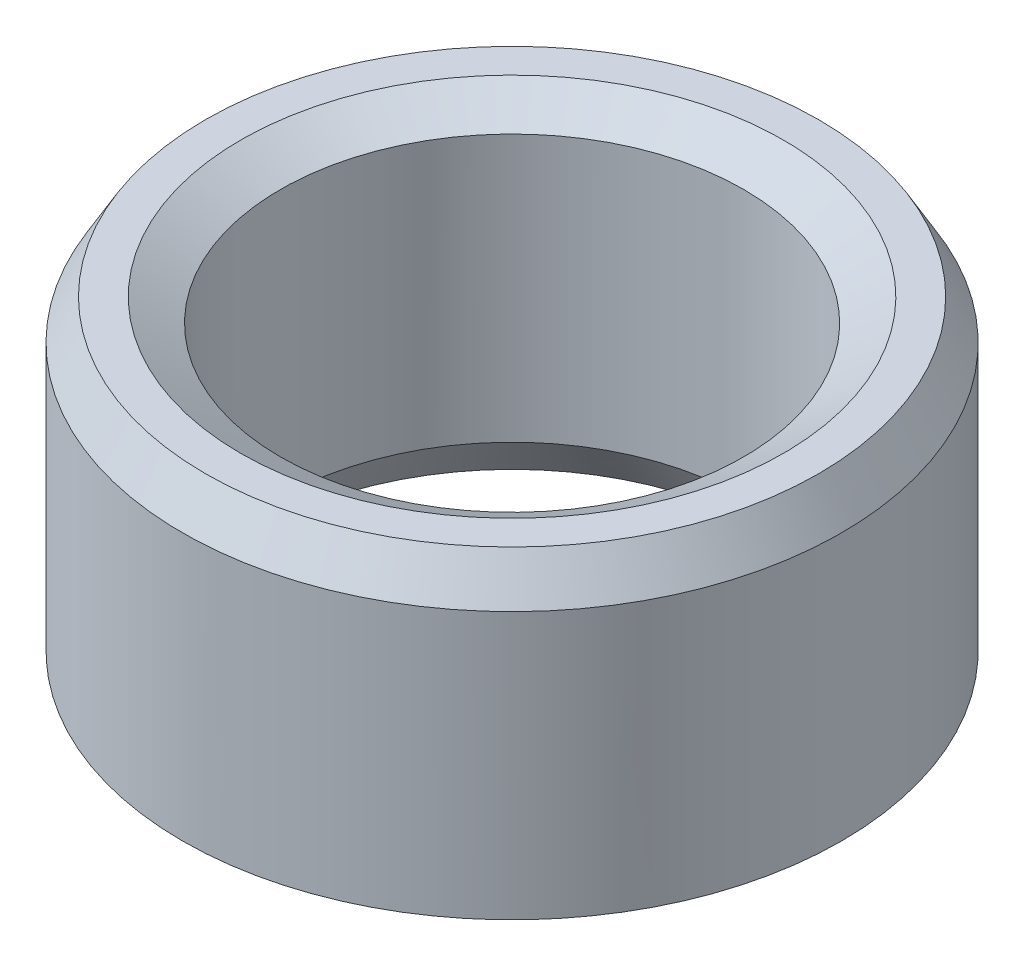
ISO-10303-21;
HEADER;
FILE_DESCRIPTION(('STEP AP214'),'2;1');
FILE_NAME('part.step','',(''),(''),'','','');
FILE_SCHEMA(('AUTOMOTIVE_DESIGN { 1 0 10303 214 1 1 1 1 }'));
ENDSEC;
DATA;
#1=APPLICATION_CONTEXT('core data for automotive mechanical design processes');
#2=APPLICATION_PROTOCOL_DEFINITION('international standard','automotive_design',2000,#1);
#3=PRODUCT_CONTEXT('',#1,'mechanical');
#4=PRODUCT('Part','Part','',(#3));
#5=PRODUCT_RELATED_PRODUCT_CATEGORY('part','',(#4));
#6=PRODUCT_DEFINITION_FORMATION('','',#4);
#7=PRODUCT_DEFINITION_CONTEXT('part definition',#1,'design');
#8=PRODUCT_DEFINITION('design','',#6,#7);
#9=PRODUCT_DEFINITION_SHAPE('','',#8);
#10=(LENGTH_UNIT() NAMED_UNIT(*) SI_UNIT(.MILLI.,.METRE.));
#11=(NAMED_UNIT(*) PLANE_ANGLE_UNIT() SI_UNIT($,.RADIAN.));
#12=(NAMED_UNIT(*) SI_UNIT($,.STERADIAN.) SOLID_ANGLE_UNIT());
#13=UNCERTAINTY_MEASURE_WITH_UNIT(LENGTH_MEASURE(1.E-05),#10,'distance_accuracy_value','');
#14=(GEOMETRIC_REPRESENTATION_CONTEXT(3) GLOBAL_UNCERTAINTY_ASSIGNED_CONTEXT((#13)) GLOBAL_UNIT_ASSIGNED_CONTEXT((#10,
#11,#12)) REPRESENTATION_CONTEXT('',''));
#15=CARTESIAN_POINT('',(0.,0.,0.));
#16=DIRECTION('',(0.,0.,1.));
#17=DIRECTION('',(1.,0.,0.));
#18=AXIS2_PLACEMENT_3D('',#15,#16,#17);
#19=CARTESIAN_POINT('',(0.,29.9992679971099,0.));
#20=DIRECTION('',(0.,-1.,0.));
#21=DIRECTION('',(0.,0.,-1.));
#22=AXIS2_PLACEMENT_3D('',#19,#20,#21);
#23=CYLINDRICAL_SURFACE('',#22,30.);
#24=CARTESIAN_POINT('',(0.,2.0882425429334,0.));
#25=DIRECTION('',(0.,1.,0.));
#26=DIRECTION('',(0.,0.,1.));
#27=AXIS2_PLACEMENT_3D('',#24,#25,#26);
#28=CIRCLE('',#27,30.);
#29=CARTESIAN_POINT('',(0.,2.0882425429334,-30.));
#30=VERTEX_POINT('',#29);
#31=EDGE_CURVE('E10',#30,#30,#28,.T.);
#32=CARTESIAN_POINT('',(0.,26.3823258142225,0.));
#33=DIRECTION('',(0.,1.,0.));
#34=DIRECTION('',(0.,0.,1.));
#35=AXIS2_PLACEMENT_3D('',#32,#33,#34);
#36=CIRCLE('',#35,30.);
#37=CARTESIAN_POINT('',(0.,26.3823258142225,-30.));
#38=VERTEX_POINT('',#37);
#39=EDGE_CURVE('E50',#38,#38,#36,.F.);
#40=CARTESIAN_POINT('',(0.,2.0882425429334,-30.));
#41=CARTESIAN_POINT('',(0.,2.34130591034266,-30.));
#42=CARTESIAN_POINT('',(0.,2.59436927775192,-30.));
#43=CARTESIAN_POINT('',(0.,3.10049601257045,-30.));
#44=CARTESIAN_POINT('',(0.,3.35355937997971,-30.));
#45=CARTESIAN_POINT('',(0.,3.85968611479823,-30.));
#46=CARTESIAN_POINT('',(0.,4.11274948220749,-30.));
#47=CARTESIAN_POINT('',(0.,4.61887621702602,-30.));
#48=CARTESIAN_POINT('',(0.,4.87193958443528,-30.));
#49=CARTESIAN_POINT('',(0.,5.3780663192538,-30.));
#50=CARTESIAN_POINT('',(0.,5.63112968666306,-30.));
#51=CARTESIAN_POINT('',(0.,6.13725642148159,-30.));
#52=CARTESIAN_POINT('',(0.,6.39031978889085,-30.));
#53=CARTESIAN_POINT('',(0.,6.89644652370937,-30.));
#54=CARTESIAN_POINT('',(0.,7.14950989111863,-30.));
#55=CARTESIAN_POINT('',(0.,7.65563662593716,-30.));
#56=CARTESIAN_POINT('',(0.,7.90869999334642,-30.));
#57=CARTESIAN_POINT('',(0.,8.41482672816494,-30.));
#58=CARTESIAN_POINT('',(0.,8.6678900955742,-30.));
#59=CARTESIAN_POINT('',(0.,9.17401683039273,-30.));
#60=CARTESIAN_POINT('',(0.,9.42708019780199,-30.));
#61=CARTESIAN_POINT('',(0.,9.93320693262051,-30.));
#62=CARTESIAN_POINT('',(0.,10.1862703000298,-30.));
#63=CARTESIAN_POINT('',(0.,10.6923970348483,-30.));
#64=CARTESIAN_POINT('',(0.,10.9454604022576,-30.));
#65=CARTESIAN_POINT('',(0.,11.4515871370761,-30.));
#66=CARTESIAN_POINT('',(0.,11.7046505044853,-30.));
#67=CARTESIAN_POINT('',(0.,12.2107772393039,-30.));
#68=CARTESIAN_POINT('',(0.,12.4638406067131,-30.));
#69=CARTESIAN_POINT('',(0.,12.9699673415317,-30.));
#70=CARTESIAN_POINT('',(0.,13.2230307089409,-30.));
#71=CARTESIAN_POINT('',(0.,13.7291574437594,-30.));
#72=CARTESIAN_POINT('',(0.,13.9822208111687,-30.));
#73=CARTESIAN_POINT('',(0.,14.4883475459872,-30.));
#74=CARTESIAN_POINT('',(0.,14.7414109133965,-30.));
#75=CARTESIAN_POINT('',(0.,15.247537648215,-30.));
#76=CARTESIAN_POINT('',(0.,15.5006010156243,-30.));
#77=CARTESIAN_POINT('',(0.,16.0067277504428,-30.));
#78=CARTESIAN_POINT('',(0.,16.2597911178521,-30.));
#79=CARTESIAN_POINT('',(0.,16.7659178526706,-30.));
#80=CARTESIAN_POINT('',(0.,17.0189812200798,-30.));
#81=CARTESIAN_POINT('',(0.,17.5251079548984,-30.));
#82=CARTESIAN_POINT('',(0.,17.7781713223076,-30.));
#83=CARTESIAN_POINT('',(0.,18.2842980571262,-30.));
#84=CARTESIAN_POINT('',(0.,18.5373614245354,-30.));
#85=CARTESIAN_POINT('',(0.,19.0434881593539,-30.));
#86=CARTESIAN_POINT('',(0.,19.2965515267632,-30.));
#87=CARTESIAN_POINT('',(0.,19.8026782615817,-30.));
#88=CARTESIAN_POINT('',(0.,20.055741628991,-30.));
#89=CARTESIAN_POINT('',(0.,20.5618683638095,-30.));
#90=CARTESIAN_POINT('',(0.,20.8149317312188,-30.));
#91=CARTESIAN_POINT('',(0.,21.3210584660373,-30.));
#92=CARTESIAN_POINT('',(0.,21.5741218334466,-30.));
#93=CARTESIAN_POINT('',(0.,22.0802485682651,-30.));
#94=CARTESIAN_POINT('',(0.,22.3333119356743,-30.));
#95=CARTESIAN_POINT('',(0.,22.8394386704929,-30.));
#96=CARTESIAN_POINT('',(0.,23.0925020379021,-30.));
#97=CARTESIAN_POINT('',(0.,23.5986287727206,-30.));
#98=CARTESIAN_POINT('',(0.,23.8516921401299,-30.));
#99=CARTESIAN_POINT('',(0.,24.3578188749484,-30.));
#100=CARTESIAN_POINT('',(0.,24.6108822423577,-30.));
#101=CARTESIAN_POINT('',(0.,25.1170089771762,-30.));
#102=CARTESIAN_POINT('',(0.,25.3700723445855,-30.));
#103=CARTESIAN_POINT('',(0.,25.876199079404,-30.));
#104=CARTESIAN_POINT('',(0.,26.1292624468133,-30.));
#105=CARTESIAN_POINT('',(0.,26.3823258142225,-30.));
#106=B_SPLINE_CURVE_WITH_KNOTS('',3,(#40,#41,#42,#43,#44,#45,#46,#47,#48,#49,#50,#51,#52,#53,
#54,#55,#56,#57,#58,#59,#60,#61,#62,#63,#64,#65,#66,#67,#68,#69,#70,#71,#72,#73,#74,#75,#76,#77,
#78,#79,#80,#81,#82,#83,#84,#85,#86,#87,#88,#89,#90,#91,#92,#93,#94,#95,#96,#97,#98,#99,#100,
#101,#102,#103,#104,#105),.UNSPECIFIED.,.F.,.F.,(4,2,2,2,2,2,2,2,2,2,2,2,2,2,2,2,2,2,2,2,2,2,2,
2,2,2,2,2,2,2,2,2,4),(0.,0.759190102227785,1.51838020445557,2.27757030668336,3.03676040891114,
3.79595051113893,4.55514061336671,5.3143307155945,6.07352081782228,6.83271092005007,
7.59190102227785,8.35109112450564,9.11028122673342,9.86947132896121,10.628661431189,
11.3878515334168,12.1470416356446,12.9062317378723,13.6654218401001,14.4246119423279,
15.1838020445557,15.9429921467835,16.7021822490113,17.4613723512391,18.2205624534668,
18.9797525556946,19.7389426579224,20.4981327601502,21.257322862378,22.0165129646058,
22.7757030668336,23.5348931690613,24.2940832712891),.UNSPECIFIED.);
#107=EDGE_CURVE('BSEAM39',#30,#38,#106,.T.);
#108=ORIENTED_EDGE('',*,*,#31,.T.);
#109=ORIENTED_EDGE('',*,*,#39,.T.);
#110=ORIENTED_EDGE('',*,*,#107,.T.);
#111=ORIENTED_EDGE('',*,*,#107,.F.);
#112=EDGE_LOOP('',(#108,#110,#109,#111));
#113=FACE_BOUND('',#112,.T.);
#114=ADVANCED_FACE('F39',(#113),#23,.T.);
#115=CARTESIAN_POINT('',(0.,29.9992679971099,0.));
#116=DIRECTION('',(0.,1.,0.));
#117=DIRECTION('',(0.,0.,1.));
#118=AXIS2_PLACEMENT_3D('',#115,#116,#117);
#119=PLANE('',#118);
#120=CARTESIAN_POINT('',(0.,29.9992679971099,0.));
#121=DIRECTION('',(0.,1.,0.));
#122=DIRECTION('',(0.,0.,1.));
#123=AXIS2_PLACEMENT_3D('',#120,#121,#122);
#124=CIRCLE('',#123,24.7042899830472);
#125=CARTESIAN_POINT('',(0.,29.9992679971099,24.7042899830472));
#126=VERTEX_POINT('',#125);
#127=EDGE_CURVE('E58',#126,#126,#124,.F.);
#128=ORIENTED_EDGE('',*,*,#127,.T.);
#129=EDGE_LOOP('',(#128));
#130=FACE_BOUND('',#129,.T.);
#131=CARTESIAN_POINT('',(0.,29.9992679971099,0.));
#132=DIRECTION('',(0.,1.,0.));
#133=DIRECTION('',(0.,0.,1.));
#134=AXIS2_PLACEMENT_3D('',#131,#132,#133);
#135=CIRCLE('',#134,27.9117574570667);
#136=CARTESIAN_POINT('',(0.,29.9992679971099,27.9117574570667));
#137=VERTEX_POINT('',#136);
#138=EDGE_CURVE('E61',#137,#137,#135,.T.);
#139=ORIENTED_EDGE('',*,*,#138,.T.);
#140=EDGE_LOOP('',(#139));
#141=FACE_BOUND('',#140,.T.);
#142=ADVANCED_FACE('F88',(#130,#141),#119,.T.);
#143=CARTESIAN_POINT('',(0.,0.,0.));
#144=DIRECTION('',(0.,1.,0.));
#145=DIRECTION('',(0.,0.,1.));
#146=AXIS2_PLACEMENT_3D('',#143,#144,#145);
#147=PLANE('',#146);
#148=CARTESIAN_POINT('',(0.,0.,0.));
#149=DIRECTION('',(0.,1.,0.));
#150=DIRECTION('',(0.,0.,1.));
#151=AXIS2_PLACEMENT_3D('',#148,#149,#150);
#152=CIRCLE('',#151,23.175590343093);
#153=CARTESIAN_POINT('',(0.,0.,23.175590343093));
#154=VERTEX_POINT('',#153);
#155=EDGE_CURVE('E51',#154,#154,#152,.T.);
#156=ORIENTED_EDGE('',*,*,#155,.T.);
#157=EDGE_LOOP('',(#156));
#158=FACE_BOUND('',#157,.T.);
#159=CARTESIAN_POINT('',(0.,0.,0.));
#160=DIRECTION('',(0.,1.,0.));
#161=DIRECTION('',(0.,0.,1.));
#162=AXIS2_PLACEMENT_3D('',#159,#160,#161);
#163=CIRCLE('',#162,26.3830578171125);
#164=CARTESIAN_POINT('',(0.,0.,26.3830578171125));
#165=VERTEX_POINT('',#164);
#166=EDGE_CURVE('E54',#165,#165,#163,.F.);
#167=ORIENTED_EDGE('',*,*,#166,.T.);
#168=EDGE_LOOP('',(#167));
#169=FACE_BOUND('',#168,.T.);
#170=ADVANCED_FACE('F83',(#158,#169),#147,.F.);
#171=CARTESIAN_POINT('',(0.,29.9992679971099,0.));
#172=DIRECTION('',(0.,-1.,0.));
#173=DIRECTION('',(0.,0.,-1.));
#174=AXIS2_PLACEMENT_3D('',#171,#172,#173);
#175=CYLINDRICAL_SURFACE('',#174,21.0873478001597);
#176=CARTESIAN_POINT('',(0.,27.9110254541765,0.));
#177=DIRECTION('',(0.,1.,0.));
#178=DIRECTION('',(0.,0.,1.));
#179=AXIS2_PLACEMENT_3D('',#176,#177,#178);
#180=CIRCLE('',#179,21.0873478001597);
#181=CARTESIAN_POINT('',(0.,27.9110254541765,-21.0873478001597));
#182=VERTEX_POINT('',#181);
#183=EDGE_CURVE('E67',#182,#182,#180,.T.);
#184=CARTESIAN_POINT('',(0.,3.61694218288745,0.));
#185=DIRECTION('',(0.,1.,0.));
#186=DIRECTION('',(0.,0.,1.));
#187=AXIS2_PLACEMENT_3D('',#184,#185,#186);
#188=CIRCLE('',#187,21.0873478001597);
#189=CARTESIAN_POINT('',(0.,3.61694218288745,-21.0873478001597));
#190=VERTEX_POINT('',#189);
#191=EDGE_CURVE('E69',#190,#190,#188,.F.);
#192=CARTESIAN_POINT('',(0.,27.9110254541765,-21.0873478001597));
#193=CARTESIAN_POINT('',(0.,27.6579620867673,-21.0873478001597));
#194=CARTESIAN_POINT('',(0.,27.404898719358,-21.0873478001597));
#195=CARTESIAN_POINT('',(0.,26.8987719845395,-21.0873478001597));
#196=CARTESIAN_POINT('',(0.,26.6457086171302,-21.0873478001597));
#197=CARTESIAN_POINT('',(0.,26.1395818823117,-21.0873478001597));
#198=CARTESIAN_POINT('',(0.,25.8865185149024,-21.0873478001597));
#199=CARTESIAN_POINT('',(0.,25.3803917800839,-21.0873478001597));
#200=CARTESIAN_POINT('',(0.,25.1273284126747,-21.0873478001597));
#201=CARTESIAN_POINT('',(0.,24.6212016778561,-21.0873478001597));
#202=CARTESIAN_POINT('',(0.,24.3681383104469,-21.0873478001597));
#203=CARTESIAN_POINT('',(0.,23.8620115756283,-21.0873478001597));
#204=CARTESIAN_POINT('',(0.,23.6089482082191,-21.0873478001597));
#205=CARTESIAN_POINT('',(0.,23.1028214734006,-21.0873478001597));
#206=CARTESIAN_POINT('',(0.,22.8497581059913,-21.0873478001597));
#207=CARTESIAN_POINT('',(0.,22.3436313711728,-21.0873478001597));
#208=CARTESIAN_POINT('',(0.,22.0905680037635,-21.0873478001597));
#209=CARTESIAN_POINT('',(0.,21.584441268945,-21.0873478001597));
#210=CARTESIAN_POINT('',(0.,21.3313779015357,-21.0873478001597));
#211=CARTESIAN_POINT('',(0.,20.8252511667172,-21.0873478001597));
#212=CARTESIAN_POINT('',(0.,20.572187799308,-21.0873478001597));
#213=CARTESIAN_POINT('',(0.,20.0660610644894,-21.0873478001597));
#214=CARTESIAN_POINT('',(0.,19.8129976970802,-21.0873478001597));
#215=CARTESIAN_POINT('',(0.,19.3068709622616,-21.0873478001597));
#216=CARTESIAN_POINT('',(0.,19.0538075948524,-21.0873478001597));
#217=CARTESIAN_POINT('',(0.,18.5476808600339,-21.0873478001597));
#218=CARTESIAN_POINT('',(0.,18.2946174926246,-21.0873478001597));
#219=CARTESIAN_POINT('',(0.,17.7884907578061,-21.0873478001597));
#220=CARTESIAN_POINT('',(0.,17.5354273903968,-21.0873478001597));
#221=CARTESIAN_POINT('',(0.,17.0293006555783,-21.0873478001597));
#222=CARTESIAN_POINT('',(0.,16.776237288169,-21.0873478001597));
#223=CARTESIAN_POINT('',(0.,16.2701105533505,-21.0873478001597));
#224=CARTESIAN_POINT('',(0.,16.0170471859412,-21.0873478001597));
#225=CARTESIAN_POINT('',(0.,15.5109204511227,-21.0873478001597));
#226=CARTESIAN_POINT('',(0.,15.2578570837135,-21.0873478001597));
#227=CARTESIAN_POINT('',(0.,14.7517303488949,-21.0873478001597));
#228=CARTESIAN_POINT('',(0.,14.4986669814857,-21.0873478001597));
#229=CARTESIAN_POINT('',(0.,13.9925402466672,-21.0873478001597));
#230=CARTESIAN_POINT('',(0.,13.7394768792579,-21.0873478001597));
#231=CARTESIAN_POINT('',(0.,13.2333501444394,-21.0873478001597));
#232=CARTESIAN_POINT('',(0.,12.9802867770301,-21.0873478001597));
#233=CARTESIAN_POINT('',(0.,12.4741600422116,-21.0873478001597));
#234=CARTESIAN_POINT('',(0.,12.2210966748023,-21.0873478001597));
#235=CARTESIAN_POINT('',(0.,11.7149699399838,-21.0873478001597));
#236=CARTESIAN_POINT('',(0.,11.4619065725745,-21.0873478001597));
#237=CARTESIAN_POINT('',(0.,10.955779837756,-21.0873478001597));
#238=CARTESIAN_POINT('',(0.,10.7027164703468,-21.0873478001597));
#239=CARTESIAN_POINT('',(0.,10.1965897355282,-21.0873478001597));
#240=CARTESIAN_POINT('',(0.,9.94352636811898,-21.0873478001597));
#241=CARTESIAN_POINT('',(0.,9.43739963330046,-21.0873478001597));
#242=CARTESIAN_POINT('',(0.,9.1843362658912,-21.0873478001597));
#243=CARTESIAN_POINT('',(0.,8.67820953107267,-21.0873478001597));
#244=CARTESIAN_POINT('',(0.,8.42514616366341,-21.0873478001597));
#245=CARTESIAN_POINT('',(0.,7.91901942884489,-21.0873478001597));
#246=CARTESIAN_POINT('',(0.,7.66595606143563,-21.0873478001597));
#247=CARTESIAN_POINT('',(0.,7.15982932661711,-21.0873478001597));
#248=CARTESIAN_POINT('',(0.,6.90676595920784,-21.0873478001597));
#249=CARTESIAN_POINT('',(0.,6.40063922438932,-21.0873478001597));
#250=CARTESIAN_POINT('',(0.,6.14757585698006,-21.0873478001597));
#251=CARTESIAN_POINT('',(0.,5.64144912216154,-21.0873478001597));
#252=CARTESIAN_POINT('',(0.,5.38838575475228,-21.0873478001597));
#253=CARTESIAN_POINT('',(0.,4.88225901993376,-21.0873478001597));
#254=CARTESIAN_POINT('',(0.,4.6291956525245,-21.0873478001597));
#255=CARTESIAN_POINT('',(0.,4.12306891770597,-21.0873478001597));
#256=CARTESIAN_POINT('',(0.,3.87000555029671,-21.0873478001597));
#257=CARTESIAN_POINT('',(0.,3.61694218288745,-21.0873478001597));
#258=B_SPLINE_CURVE_WITH_KNOTS('',3,(#192,#193,#194,#195,#196,#197,#198,#199,#200,#201,#202,
#203,#204,#205,#206,#207,#208,#209,#210,#211,#212,#213,#214,#215,#216,#217,#218,#219,#220,#221,
#222,#223,#224,#225,#226,#227,#228,#229,#230,#231,#232,#233,#234,#235,#236,#237,#238,#239,#240,
#241,#242,#243,#244,#245,#246,#247,#248,#249,#250,#251,#252,#253,#254,#255,#256,#257),
.UNSPECIFIED.,.F.,.F.,(4,2,2,2,2,2,2,2,2,2,2,2,2,2,2,2,2,2,2,2,2,2,2,2,2,2,2,2,2,2,2,2,4),(0.,
0.759190102227782,1.51838020445557,2.27757030668335,3.03676040891113,3.79595051113892,
4.5551406133667,5.31433071559449,6.07352081782227,6.83271092005005,7.59190102227783,
8.35109112450561,9.1102812267334,9.86947132896119,10.628661431189,11.3878515334168,
12.1470416356445,12.9062317378723,13.6654218401001,14.4246119423279,15.1838020445557,
15.9429921467835,16.7021822490112,17.461372351239,18.2205624534668,18.9797525556946,
19.7389426579224,20.4981327601502,21.2573228623779,22.0165129646057,22.7757030668335,
23.5348931690613,24.2940832712891),.UNSPECIFIED.);
#259=EDGE_CURVE('BSEAM71',#182,#190,#258,.T.);
#260=ORIENTED_EDGE('',*,*,#183,.T.);
#261=ORIENTED_EDGE('',*,*,#191,.T.);
#262=ORIENTED_EDGE('',*,*,#259,.T.);
#263=ORIENTED_EDGE('',*,*,#259,.F.);
#264=EDGE_LOOP('',(#260,#262,#261,#263));
#265=FACE_BOUND('',#264,.T.);
#266=ADVANCED_FACE('F71',(#265),#175,.F.);
#267=CARTESIAN_POINT('',(0.,27.9110254541765,0.));
#268=DIRECTION('',(0.,1.,0.));
#269=DIRECTION('',(0.,0.,1.));
#270=AXIS2_PLACEMENT_3D('',#267,#268,#269);
#271=CONICAL_SURFACE('',#270,21.0873478001597,1.0471975511966);
#272=ORIENTED_EDGE('',*,*,#127,.F.);
#273=EDGE_LOOP('',(#272));
#274=FACE_BOUND('',#273,.T.);
#275=ORIENTED_EDGE('',*,*,#183,.F.);
#276=EDGE_LOOP('',(#275));
#277=FACE_BOUND('',#276,.T.);
#278=ADVANCED_FACE('F77',(#274,#277),#271,.F.);
#279=CARTESIAN_POINT('',(0.,0.,0.));
#280=DIRECTION('',(0.,-1.,0.));
#281=DIRECTION('',(0.,0.,-1.));
#282=AXIS2_PLACEMENT_3D('',#279,#280,#281);
#283=CONICAL_SURFACE('',#282,23.175590343093,0.523598775598295);
#284=ORIENTED_EDGE('',*,*,#191,.F.);
#285=EDGE_LOOP('',(#284));
#286=FACE_BOUND('',#285,.T.);
#287=ORIENTED_EDGE('',*,*,#155,.F.);
#288=EDGE_LOOP('',(#287));
#289=FACE_BOUND('',#288,.T.);
#290=ADVANCED_FACE('F73',(#286,#289),#283,.F.);
#291=CARTESIAN_POINT('',(0.,2.0882425429334,0.));
#292=DIRECTION('',(0.,1.,0.));
#293=DIRECTION('',(0.,0.,1.));
#294=AXIS2_PLACEMENT_3D('',#291,#292,#293);
#295=CONICAL_SURFACE('',#294,30.,1.0471975511966);
#296=ORIENTED_EDGE('',*,*,#166,.F.);
#297=EDGE_LOOP('',(#296));
#298=FACE_BOUND('',#297,.T.);
#299=ORIENTED_EDGE('',*,*,#31,.F.);
#300=EDGE_LOOP('',(#299));
#301=FACE_BOUND('',#300,.T.);
#302=ADVANCED_FACE('F76',(#298,#301),#295,.T.);
#303=CARTESIAN_POINT('',(0.,29.9992679971099,0.));
#304=DIRECTION('',(0.,-1.,0.));
#305=DIRECTION('',(0.,0.,-1.));
#306=AXIS2_PLACEMENT_3D('',#303,#304,#305);
#307=CONICAL_SURFACE('',#306,27.9117574570667,0.523598775598296);
#308=ORIENTED_EDGE('',*,*,#39,.F.);
#309=EDGE_LOOP('',(#308));
#310=FACE_BOUND('',#309,.T.);
#311=ORIENTED_EDGE('',*,*,#138,.F.);
#312=EDGE_LOOP('',(#311));
#313=FACE_BOUND('',#312,.T.);
#314=ADVANCED_FACE('F45',(#310,#313),#307,.T.);
#315=CLOSED_SHELL('',(#114,#142,#170,#266,#278,#290,#302,#314));
#316=MANIFOLD_SOLID_BREP('B2',#315);
#317=ADVANCED_BREP_SHAPE_REPRESENTATION('',(#18,#316),#14);
#318=SHAPE_DEFINITION_REPRESENTATION(#9,#317);
ENDSEC;
END-ISO-10303-21;
